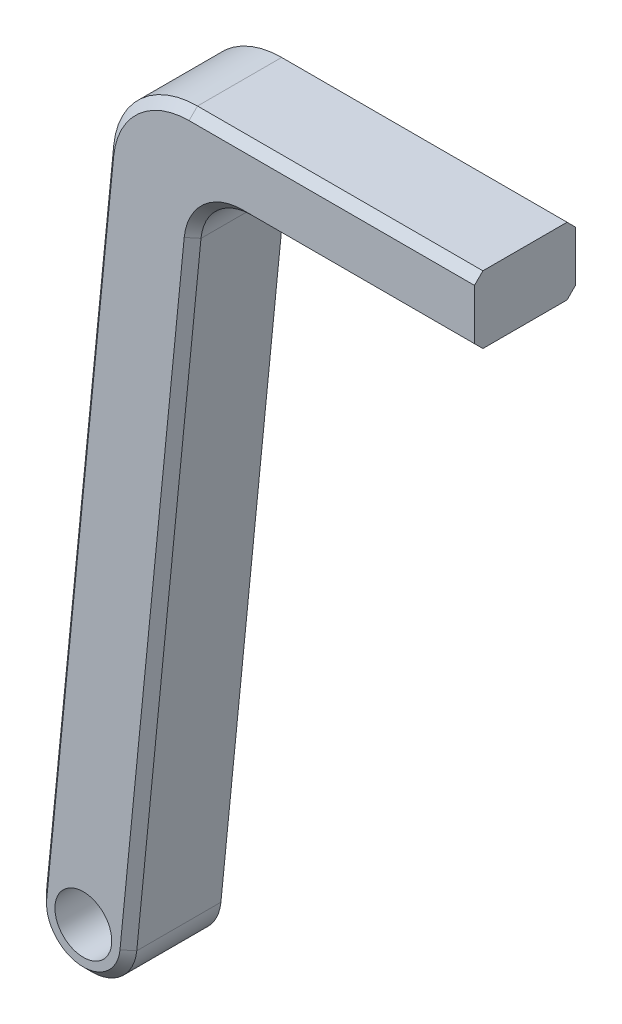
ISO-10303-21;
HEADER;
FILE_DESCRIPTION(('STEP AP214'),'2;1');
FILE_NAME('part.step','',(''),(''),'','','');
FILE_SCHEMA(('AUTOMOTIVE_DESIGN { 1 0 10303 214 1 1 1 1 }'));
ENDSEC;
DATA;
#1=APPLICATION_CONTEXT('core data for automotive mechanical design processes');
#2=APPLICATION_PROTOCOL_DEFINITION('international standard','automotive_design',2000,#1);
#3=PRODUCT_CONTEXT('',#1,'mechanical');
#4=PRODUCT('Part','Part','',(#3));
#5=PRODUCT_RELATED_PRODUCT_CATEGORY('part','',(#4));
#6=PRODUCT_DEFINITION_FORMATION('','',#4);
#7=PRODUCT_DEFINITION_CONTEXT('part definition',#1,'design');
#8=PRODUCT_DEFINITION('design','',#6,#7);
#9=PRODUCT_DEFINITION_SHAPE('','',#8);
#10=(LENGTH_UNIT() NAMED_UNIT(*) SI_UNIT(.MILLI.,.METRE.));
#11=(NAMED_UNIT(*) PLANE_ANGLE_UNIT() SI_UNIT($,.RADIAN.));
#12=(NAMED_UNIT(*) SI_UNIT($,.STERADIAN.) SOLID_ANGLE_UNIT());
#13=UNCERTAINTY_MEASURE_WITH_UNIT(LENGTH_MEASURE(1.E-05),#10,'distance_accuracy_value','');
#14=(GEOMETRIC_REPRESENTATION_CONTEXT(3) GLOBAL_UNCERTAINTY_ASSIGNED_CONTEXT((#13)) GLOBAL_UNIT_ASSIGNED_CONTEXT((#10,
#11,#12)) REPRESENTATION_CONTEXT('',''));
#15=CARTESIAN_POINT('',(0.,0.,0.));
#16=DIRECTION('',(0.,0.,1.));
#17=DIRECTION('',(1.,0.,0.));
#18=AXIS2_PLACEMENT_3D('',#15,#16,#17);
#19=CARTESIAN_POINT('',(-5.34887231495326,0.52932972552715,12.));
#20=DIRECTION('',(0.99513903534014,-0.0984799489352835,0.));
#21=DIRECTION('',(0.0984799489352836,0.99513903534014,0.));
#22=AXIS2_PLACEMENT_3D('',#19,#20,#21);
#23=PLANE('',#22);
#24=DIRECTION('',(0.,0.,-1.));
#25=VECTOR('',#24,1.);
#26=CARTESIAN_POINT('',(2.61308101270173,80.9847994893528,0.));
#27=LINE('',#26,#25);
#28=CARTESIAN_POINT('',(2.61308101270173,80.9847994893528,11.));
#29=VERTEX_POINT('',#28);
#30=CARTESIAN_POINT('',(2.61308101270173,80.9847994893528,1.));
#31=VERTEX_POINT('',#30);
#32=EDGE_CURVE('E336',#29,#31,#27,.T.);
#33=ORIENTED_EDGE('',*,*,#32,.T.);
#34=DIRECTION('',(-0.0984799489352836,-0.99513903534014,0.));
#35=VECTOR('',#34,1.);
#36=CARTESIAN_POINT('',(-5.34887231495326,0.52932972552715,1.));
#37=LINE('',#36,#35);
#38=CARTESIAN_POINT('',(-5.34887231495326,0.529329725527149,1.));
#39=VERTEX_POINT('',#38);
#40=EDGE_CURVE('E218',#31,#39,#37,.T.);
#41=ORIENTED_EDGE('',*,*,#40,.T.);
#42=DIRECTION('',(0.,0.,-1.));
#43=VECTOR('',#42,1.);
#44=CARTESIAN_POINT('',(-5.34887231495326,0.529329725527149,12.));
#45=LINE('',#44,#43);
#46=CARTESIAN_POINT('',(-5.34887231495326,0.529329725527149,11.));
#47=VERTEX_POINT('',#46);
#48=EDGE_CURVE('E324',#47,#39,#45,.T.);
#49=ORIENTED_EDGE('',*,*,#48,.F.);
#50=DIRECTION('',(0.0984799489352836,0.99513903534014,0.));
#51=VECTOR('',#50,1.);
#52=CARTESIAN_POINT('',(2.61308101270173,80.9847994893529,11.));
#53=LINE('',#52,#51);
#54=EDGE_CURVE('E215',#47,#29,#53,.T.);
#55=ORIENTED_EDGE('',*,*,#54,.T.);
#56=EDGE_LOOP('',(#33,#41,#49,#55));
#57=FACE_BOUND('',#56,.T.);
#58=ADVANCED_FACE('F43',(#57),#23,.F.);
#59=CARTESIAN_POINT('',(0.,0.,12.));
#60=DIRECTION('',(0.,0.,-1.));
#61=DIRECTION('',(-1.,0.,0.));
#62=AXIS2_PLACEMENT_3D('',#59,#60,#61);
#63=CYLINDRICAL_SURFACE('',#62,5.375);
#64=ORIENTED_EDGE('',*,*,#48,.T.);
#65=CARTESIAN_POINT('',(0.,0.,1.));
#66=DIRECTION('',(0.,0.,1.));
#67=DIRECTION('',(1.,0.,0.));
#68=AXIS2_PLACEMENT_3D('',#65,#66,#67);
#69=CIRCLE('',#68,5.375);
#70=CARTESIAN_POINT('',(5.34887231495325,-0.529329725527149,1.));
#71=VERTEX_POINT('',#70);
#72=EDGE_CURVE('E212',#39,#71,#69,.T.);
#73=ORIENTED_EDGE('',*,*,#72,.T.);
#74=DIRECTION('',(0.,0.,-1.));
#75=VECTOR('',#74,1.);
#76=CARTESIAN_POINT('',(5.34887231495325,-0.529329725527149,12.));
#77=LINE('',#76,#75);
#78=CARTESIAN_POINT('',(5.34887231495325,-0.529329725527149,11.));
#79=VERTEX_POINT('',#78);
#80=EDGE_CURVE('E314',#79,#71,#77,.T.);
#81=ORIENTED_EDGE('',*,*,#80,.F.);
#82=CARTESIAN_POINT('',(0.,0.,11.));
#83=DIRECTION('',(0.,0.,1.));
#84=DIRECTION('',(1.,0.,0.));
#85=AXIS2_PLACEMENT_3D('',#82,#83,#84);
#86=CIRCLE('',#85,5.375);
#87=EDGE_CURVE('E209',#79,#47,#86,.F.);
#88=ORIENTED_EDGE('',*,*,#87,.T.);
#89=EDGE_LOOP('',(#64,#73,#81,#88));
#90=FACE_BOUND('',#89,.T.);
#91=ADVANCED_FACE('F423',(#90),#63,.T.);
#92=CARTESIAN_POINT('',(5.34887231495325,-0.529329725527149,12.));
#93=DIRECTION('',(0.99513903534014,-0.0984799489352834,0.));
#94=DIRECTION('',(0.0984799489352834,0.99513903534014,0.));
#95=AXIS2_PLACEMENT_3D('',#92,#93,#94);
#96=PLANE('',#95);
#97=ORIENTED_EDGE('',*,*,#80,.T.);
#98=DIRECTION('',(0.0984799489352834,0.99513903534014,0.));
#99=VECTOR('',#98,1.);
#100=CARTESIAN_POINT('',(12.980764960868,76.5908796936117,1.));
#101=LINE('',#100,#99);
#102=CARTESIAN_POINT('',(12.980764960868,76.5908796936117,1.));
#103=VERTEX_POINT('',#102);
#104=EDGE_CURVE('E206',#71,#103,#101,.T.);
#105=ORIENTED_EDGE('',*,*,#104,.T.);
#106=DIRECTION('',(0.,0.,-1.));
#107=VECTOR('',#106,1.);
#108=CARTESIAN_POINT('',(12.980764960868,76.5908796936117,12.));
#109=LINE('',#108,#107);
#110=CARTESIAN_POINT('',(12.980764960868,76.5908796936117,11.));
#111=VERTEX_POINT('',#110);
#112=EDGE_CURVE('E332',#103,#111,#109,.F.);
#113=ORIENTED_EDGE('',*,*,#112,.T.);
#114=DIRECTION('',(-0.0984799489352834,-0.99513903534014,0.));
#115=VECTOR('',#114,1.);
#116=CARTESIAN_POINT('',(5.34887231495325,-0.529329725527149,11.));
#117=LINE('',#116,#115);
#118=EDGE_CURVE('E203',#111,#79,#117,.T.);
#119=ORIENTED_EDGE('',*,*,#118,.T.);
#120=EDGE_LOOP('',(#97,#105,#113,#119));
#121=FACE_BOUND('',#120,.T.);
#122=ADVANCED_FACE('F393',(#121),#96,.T.);
#123=CARTESIAN_POINT('',(0.,82.,12.));
#124=DIRECTION('',(0.,-1.,0.));
#125=DIRECTION('',(0.,0.,-1.));
#126=AXIS2_PLACEMENT_3D('',#123,#124,#125);
#127=PLANE('',#126);
#128=DIRECTION('',(0.,0.,-1.));
#129=VECTOR('',#128,1.);
#130=CARTESIAN_POINT('',(18.9515991729089,82.,0.));
#131=LINE('',#130,#129);
#132=CARTESIAN_POINT('',(18.9515991729089,82.,11.));
#133=VERTEX_POINT('',#132);
#134=CARTESIAN_POINT('',(18.9515991729089,82.,1.));
#135=VERTEX_POINT('',#134);
#136=EDGE_CURVE('E328',#133,#135,#131,.T.);
#137=ORIENTED_EDGE('',*,*,#136,.T.);
#138=DIRECTION('',(1.,0.,0.));
#139=VECTOR('',#138,1.);
#140=CARTESIAN_POINT('',(46.4739345166854,82.,1.));
#141=LINE('',#140,#139);
#142=CARTESIAN_POINT('',(46.4739345166854,82.,1.));
#143=VERTEX_POINT('',#142);
#144=EDGE_CURVE('E363',#135,#143,#141,.T.);
#145=ORIENTED_EDGE('',*,*,#144,.T.);
#146=DIRECTION('',(0.,0.,-1.));
#147=VECTOR('',#146,1.);
#148=CARTESIAN_POINT('',(46.4739345166854,82.,12.));
#149=LINE('',#148,#147);
#150=CARTESIAN_POINT('',(46.4739345166854,82.,11.));
#151=VERTEX_POINT('',#150);
#152=EDGE_CURVE('E309',#151,#143,#149,.T.);
#153=ORIENTED_EDGE('',*,*,#152,.F.);
#154=DIRECTION('',(-1.,0.,0.));
#155=VECTOR('',#154,1.);
#156=CARTESIAN_POINT('',(0.,82.,11.));
#157=LINE('',#156,#155);
#158=EDGE_CURVE('E359',#151,#133,#157,.T.);
#159=ORIENTED_EDGE('',*,*,#158,.T.);
#160=EDGE_LOOP('',(#137,#145,#153,#159));
#161=FACE_BOUND('',#160,.T.);
#162=ADVANCED_FACE('F369',(#161),#127,.T.);
#163=CARTESIAN_POINT('',(46.4739345166854,0.,12.));
#164=DIRECTION('',(1.,0.,0.));
#165=DIRECTION('',(0.,0.,-1.));
#166=AXIS2_PLACEMENT_3D('',#163,#164,#165);
#167=PLANE('',#166);
#168=ORIENTED_EDGE('',*,*,#152,.T.);
#169=DIRECTION('',(0.,0.707106781186552,-0.707106781186543));
#170=VECTOR('',#169,1.);
#171=CARTESIAN_POINT('',(46.4739345166854,35.4999999999994,47.4999999999999));
#172=LINE('',#171,#170);
#173=CARTESIAN_POINT('',(46.4739345166854,83.,0.));
#174=VERTEX_POINT('',#173);
#175=EDGE_CURVE('E179',#143,#174,#172,.T.);
#176=ORIENTED_EDGE('',*,*,#175,.T.);
#177=DIRECTION('',(0.,-1.,0.));
#178=VECTOR('',#177,1.);
#179=CARTESIAN_POINT('',(46.4739345166854,0.,0.));
#180=LINE('',#179,#178);
#181=CARTESIAN_POINT('',(46.4739345166854,89.,0.));
#182=VERTEX_POINT('',#181);
#183=EDGE_CURVE('E161',#182,#174,#180,.T.);
#184=ORIENTED_EDGE('',*,*,#183,.F.);
#185=DIRECTION('',(0.,0.707106781186552,0.707106781186543));
#186=VECTOR('',#185,1.);
#187=CARTESIAN_POINT('',(46.4739345166854,50.4999999999994,-38.5000000000001));
#188=LINE('',#187,#186);
#189=CARTESIAN_POINT('',(46.4739345166854,90.,1.));
#190=VERTEX_POINT('',#189);
#191=EDGE_CURVE('E176',#182,#190,#188,.T.);
#192=ORIENTED_EDGE('',*,*,#191,.T.);
#193=DIRECTION('',(0.,0.,-1.));
#194=VECTOR('',#193,1.);
#195=CARTESIAN_POINT('',(46.4739345166854,90.,12.));
#196=LINE('',#195,#194);
#197=CARTESIAN_POINT('',(46.4739345166854,90.,11.));
#198=VERTEX_POINT('',#197);
#199=EDGE_CURVE('E304',#198,#190,#196,.T.);
#200=ORIENTED_EDGE('',*,*,#199,.F.);
#201=DIRECTION('',(0.,0.707106781186548,-0.707106781186548));
#202=VECTOR('',#201,1.);
#203=CARTESIAN_POINT('',(46.4739345166854,44.5,56.5));
#204=LINE('',#203,#202);
#205=CARTESIAN_POINT('',(46.4739345166854,89.,12.));
#206=VERTEX_POINT('',#205);
#207=EDGE_CURVE('E194',#198,#206,#204,.F.);
#208=ORIENTED_EDGE('',*,*,#207,.T.);
#209=DIRECTION('',(0.,-1.,0.));
#210=VECTOR('',#209,1.);
#211=CARTESIAN_POINT('',(46.4739345166854,0.,12.));
#212=LINE('',#211,#210);
#213=CARTESIAN_POINT('',(46.4739345166854,83.,12.));
#214=VERTEX_POINT('',#213);
#215=EDGE_CURVE('E317',#206,#214,#212,.T.);
#216=ORIENTED_EDGE('',*,*,#215,.T.);
#217=DIRECTION('',(0.,0.707106781186548,0.707106781186548));
#218=VECTOR('',#217,1.);
#219=CARTESIAN_POINT('',(46.4739345166854,41.5,-29.5));
#220=LINE('',#219,#218);
#221=EDGE_CURVE('E188',#214,#151,#220,.F.);
#222=ORIENTED_EDGE('',*,*,#221,.T.);
#223=EDGE_LOOP('',(#168,#176,#184,#192,#200,#208,#216,#222));
#224=FACE_BOUND('',#223,.T.);
#225=ADVANCED_FACE('F174',(#224),#167,.T.);
#226=CARTESIAN_POINT('',(0.,90.,12.));
#227=DIRECTION('',(0.,1.,0.));
#228=DIRECTION('',(0.,0.,1.));
#229=AXIS2_PLACEMENT_3D('',#226,#227,#228);
#230=PLANE('',#229);
#231=ORIENTED_EDGE('',*,*,#199,.T.);
#232=DIRECTION('',(-1.,0.,0.));
#233=VECTOR('',#232,1.);
#234=CARTESIAN_POINT('',(12.5644713661031,90.,1.));
#235=LINE('',#234,#233);
#236=CARTESIAN_POINT('',(12.5644713661031,90.,1.));
#237=VERTEX_POINT('',#236);
#238=EDGE_CURVE('E186',#190,#237,#235,.T.);
#239=ORIENTED_EDGE('',*,*,#238,.T.);
#240=DIRECTION('',(0.,0.,-1.));
#241=VECTOR('',#240,1.);
#242=CARTESIAN_POINT('',(12.5644713661031,90.,12.));
#243=LINE('',#242,#241);
#244=CARTESIAN_POINT('',(12.5644713661031,90.,11.));
#245=VERTEX_POINT('',#244);
#246=EDGE_CURVE('E170',#237,#245,#243,.F.);
#247=ORIENTED_EDGE('',*,*,#246,.T.);
#248=DIRECTION('',(1.,0.,0.));
#249=VECTOR('',#248,1.);
#250=CARTESIAN_POINT('',(0.,90.,11.));
#251=LINE('',#250,#249);
#252=EDGE_CURVE('E227',#245,#198,#251,.T.);
#253=ORIENTED_EDGE('',*,*,#252,.T.);
#254=EDGE_LOOP('',(#231,#239,#247,#253));
#255=FACE_BOUND('',#254,.T.);
#256=ADVANCED_FACE('F303',(#255),#230,.T.);
#257=CARTESIAN_POINT('',(0.,0.,12.));
#258=DIRECTION('',(0.,0.,-1.));
#259=DIRECTION('',(-1.,0.,0.));
#260=AXIS2_PLACEMENT_3D('',#257,#258,#259);
#261=CYLINDRICAL_SURFACE('',#260,3.375);
#262=CARTESIAN_POINT('',(0.,0.,12.));
#263=DIRECTION('',(0.,0.,1.));
#264=DIRECTION('',(1.,0.,0.));
#265=AXIS2_PLACEMENT_3D('',#262,#263,#264);
#266=CIRCLE('',#265,3.375);
#267=CARTESIAN_POINT('',(3.375,0.,12.));
#268=VERTEX_POINT('',#267);
#269=EDGE_CURVE('E310',#268,#268,#266,.T.);
#270=ORIENTED_EDGE('',*,*,#269,.T.);
#271=EDGE_LOOP('',(#270));
#272=FACE_BOUND('',#271,.T.);
#273=CARTESIAN_POINT('',(0.,0.,0.));
#274=DIRECTION('',(0.,0.,1.));
#275=DIRECTION('',(1.,0.,0.));
#276=AXIS2_PLACEMENT_3D('',#273,#274,#275);
#277=CIRCLE('',#276,3.375);
#278=CARTESIAN_POINT('',(3.375,0.,0.));
#279=VERTEX_POINT('',#278);
#280=EDGE_CURVE('E181',#279,#279,#277,.T.);
#281=ORIENTED_EDGE('',*,*,#280,.F.);
#282=EDGE_LOOP('',(#281));
#283=FACE_BOUND('',#282,.T.);
#284=ADVANCED_FACE('F411',(#272,#283),#261,.F.);
#285=CARTESIAN_POINT('',(0.,0.,12.));
#286=DIRECTION('',(0.,0.,1.));
#287=DIRECTION('',(1.,0.,0.));
#288=AXIS2_PLACEMENT_3D('',#285,#286,#287);
#289=PLANE('',#288);
#290=CARTESIAN_POINT('',(18.9515991729089,76.,12.));
#291=DIRECTION('',(0.,0.,1.));
#292=DIRECTION('',(1.,0.,0.));
#293=AXIS2_PLACEMENT_3D('',#290,#291,#292);
#294=CIRCLE('',#293,7.00000000000001);
#295=CARTESIAN_POINT('',(11.9856259255279,76.689359642547,12.));
#296=VERTEX_POINT('',#295);
#297=CARTESIAN_POINT('',(18.9515991729089,83.,12.));
#298=VERTEX_POINT('',#297);
#299=EDGE_CURVE('E53',#296,#298,#294,.F.);
#300=ORIENTED_EDGE('',*,*,#299,.T.);
#301=DIRECTION('',(1.,0.,0.));
#302=VECTOR('',#301,1.);
#303=CARTESIAN_POINT('',(0.,83.,12.));
#304=LINE('',#303,#302);
#305=EDGE_CURVE('E12',#298,#214,#304,.T.);
#306=ORIENTED_EDGE('',*,*,#305,.T.);
#307=ORIENTED_EDGE('',*,*,#215,.F.);
#308=DIRECTION('',(-1.,0.,0.));
#309=VECTOR('',#308,1.);
#310=CARTESIAN_POINT('',(0.,89.,12.));
#311=LINE('',#310,#309);
#312=CARTESIAN_POINT('',(12.5644713661031,89.,12.));
#313=VERTEX_POINT('',#312);
#314=EDGE_CURVE('E232',#206,#313,#311,.T.);
#315=ORIENTED_EDGE('',*,*,#314,.T.);
#316=CARTESIAN_POINT('',(12.5644713661031,80.,12.));
#317=DIRECTION('',(0.,0.,1.));
#318=DIRECTION('',(1.,0.,0.));
#319=AXIS2_PLACEMENT_3D('',#316,#317,#318);
#320=CIRCLE('',#319,8.99999999999999);
#321=CARTESIAN_POINT('',(3.60822004804187,80.8863195404175,12.));
#322=VERTEX_POINT('',#321);
#323=EDGE_CURVE('E235',#313,#322,#320,.T.);
#324=ORIENTED_EDGE('',*,*,#323,.T.);
#325=DIRECTION('',(-0.0984799489352836,-0.99513903534014,0.));
#326=VECTOR('',#325,1.);
#327=CARTESIAN_POINT('',(-4.35373327961312,0.430849776591866,12.));
#328=LINE('',#327,#326);
#329=CARTESIAN_POINT('',(-4.35373327961312,0.430849776591866,12.));
#330=VERTEX_POINT('',#329);
#331=EDGE_CURVE('E238',#322,#330,#328,.T.);
#332=ORIENTED_EDGE('',*,*,#331,.T.);
#333=CARTESIAN_POINT('',(0.,0.,12.));
#334=DIRECTION('',(0.,0.,1.));
#335=DIRECTION('',(1.,0.,0.));
#336=AXIS2_PLACEMENT_3D('',#333,#334,#335);
#337=CIRCLE('',#336,4.375);
#338=CARTESIAN_POINT('',(4.35373327961311,-0.430849776591865,12.));
#339=VERTEX_POINT('',#338);
#340=EDGE_CURVE('E241',#330,#339,#337,.T.);
#341=ORIENTED_EDGE('',*,*,#340,.T.);
#342=DIRECTION('',(0.0984799489352834,0.99513903534014,0.));
#343=VECTOR('',#342,1.);
#344=CARTESIAN_POINT('',(4.35373327961311,-0.430849776591865,12.));
#345=LINE('',#344,#343);
#346=EDGE_CURVE('E64',#339,#296,#345,.T.);
#347=ORIENTED_EDGE('',*,*,#346,.T.);
#348=EDGE_LOOP('',(#300,#306,#307,#315,#324,#332,#341,#347));
#349=FACE_BOUND('',#348,.T.);
#350=ORIENTED_EDGE('',*,*,#269,.F.);
#351=EDGE_LOOP('',(#350));
#352=FACE_BOUND('',#351,.T.);
#353=ADVANCED_FACE('F403',(#349,#352),#289,.T.);
#354=CARTESIAN_POINT('',(0.,0.,0.));
#355=DIRECTION('',(0.,0.,1.));
#356=DIRECTION('',(1.,0.,0.));
#357=AXIS2_PLACEMENT_3D('',#354,#355,#356);
#358=PLANE('',#357);
#359=ORIENTED_EDGE('',*,*,#183,.T.);
#360=DIRECTION('',(-1.,0.,0.));
#361=VECTOR('',#360,1.);
#362=CARTESIAN_POINT('',(18.9515991729089,83.,0.));
#363=LINE('',#362,#361);
#364=CARTESIAN_POINT('',(18.9515991729089,83.,0.));
#365=VERTEX_POINT('',#364);
#366=EDGE_CURVE('E356',#174,#365,#363,.T.);
#367=ORIENTED_EDGE('',*,*,#366,.T.);
#368=CARTESIAN_POINT('',(18.9515991729089,76.,0.));
#369=DIRECTION('',(0.,0.,1.));
#370=DIRECTION('',(1.,0.,0.));
#371=AXIS2_PLACEMENT_3D('',#368,#369,#370);
#372=CIRCLE('',#371,7.00000000000002);
#373=CARTESIAN_POINT('',(11.9856259255279,76.689359642547,0.));
#374=VERTEX_POINT('',#373);
#375=EDGE_CURVE('E353',#365,#374,#372,.T.);
#376=ORIENTED_EDGE('',*,*,#375,.T.);
#377=DIRECTION('',(-0.0984799489352834,-0.99513903534014,0.));
#378=VECTOR('',#377,1.);
#379=CARTESIAN_POINT('',(4.3537332796131,-0.430849776591864,0.));
#380=LINE('',#379,#378);
#381=CARTESIAN_POINT('',(4.3537332796131,-0.430849776591863,0.));
#382=VERTEX_POINT('',#381);
#383=EDGE_CURVE('E350',#374,#382,#380,.T.);
#384=ORIENTED_EDGE('',*,*,#383,.T.);
#385=CARTESIAN_POINT('',(0.,0.,0.));
#386=DIRECTION('',(0.,0.,1.));
#387=DIRECTION('',(1.,0.,0.));
#388=AXIS2_PLACEMENT_3D('',#385,#386,#387);
#389=CIRCLE('',#388,4.37499999999998);
#390=CARTESIAN_POINT('',(-4.35373327961311,0.430849776591865,0.));
#391=VERTEX_POINT('',#390);
#392=EDGE_CURVE('E347',#382,#391,#389,.F.);
#393=ORIENTED_EDGE('',*,*,#392,.T.);
#394=DIRECTION('',(0.0984799489352836,0.99513903534014,0.));
#395=VECTOR('',#394,1.);
#396=CARTESIAN_POINT('',(-4.35373327961311,0.430849776591866,0.));
#397=LINE('',#396,#395);
#398=CARTESIAN_POINT('',(3.60822004804189,80.8863195404175,0.));
#399=VERTEX_POINT('',#398);
#400=EDGE_CURVE('E344',#391,#399,#397,.T.);
#401=ORIENTED_EDGE('',*,*,#400,.T.);
#402=CARTESIAN_POINT('',(12.5644713661031,80.,0.));
#403=DIRECTION('',(0.,0.,1.));
#404=DIRECTION('',(1.,0.,0.));
#405=AXIS2_PLACEMENT_3D('',#402,#403,#404);
#406=CIRCLE('',#405,8.99999999999998);
#407=CARTESIAN_POINT('',(12.5644713661031,89.,0.));
#408=VERTEX_POINT('',#407);
#409=EDGE_CURVE('E164',#399,#408,#406,.F.);
#410=ORIENTED_EDGE('',*,*,#409,.T.);
#411=DIRECTION('',(1.,0.,0.));
#412=VECTOR('',#411,1.);
#413=CARTESIAN_POINT('',(46.4739345166854,89.,0.));
#414=LINE('',#413,#412);
#415=EDGE_CURVE('E156',#408,#182,#414,.T.);
#416=ORIENTED_EDGE('',*,*,#415,.T.);
#417=EDGE_LOOP('',(#359,#367,#376,#384,#393,#401,#410,#416));
#418=FACE_BOUND('',#417,.T.);
#419=ORIENTED_EDGE('',*,*,#280,.T.);
#420=EDGE_LOOP('',(#419));
#421=FACE_BOUND('',#420,.T.);
#422=ADVANCED_FACE('F158',(#418,#421),#358,.F.);
#423=CARTESIAN_POINT('',(18.9515991729089,76.,12.));
#424=DIRECTION('',(0.,0.,1.));
#425=DIRECTION('',(1.,0.,0.));
#426=AXIS2_PLACEMENT_3D('',#423,#424,#425);
#427=CYLINDRICAL_SURFACE('',#426,6.);
#428=ORIENTED_EDGE('',*,*,#112,.F.);
#429=CARTESIAN_POINT('',(18.9515991729089,76.,1.));
#430=DIRECTION('',(0.,0.,1.));
#431=DIRECTION('',(1.,0.,0.));
#432=AXIS2_PLACEMENT_3D('',#429,#430,#431);
#433=CIRCLE('',#432,6.);
#434=EDGE_CURVE('E200',#103,#135,#433,.F.);
#435=ORIENTED_EDGE('',*,*,#434,.T.);
#436=ORIENTED_EDGE('',*,*,#136,.F.);
#437=CARTESIAN_POINT('',(18.9515991729089,76.,11.));
#438=DIRECTION('',(0.,0.,1.));
#439=DIRECTION('',(1.,0.,0.));
#440=AXIS2_PLACEMENT_3D('',#437,#438,#439);
#441=CIRCLE('',#440,6.);
#442=EDGE_CURVE('E192',#133,#111,#441,.T.);
#443=ORIENTED_EDGE('',*,*,#442,.T.);
#444=EDGE_LOOP('',(#428,#435,#436,#443));
#445=FACE_BOUND('',#444,.T.);
#446=ADVANCED_FACE('F389',(#445),#427,.F.);
#447=CARTESIAN_POINT('',(12.5644713661031,80.,12.));
#448=DIRECTION('',(0.,0.,1.));
#449=DIRECTION('',(1.,0.,0.));
#450=AXIS2_PLACEMENT_3D('',#447,#448,#449);
#451=CYLINDRICAL_SURFACE('',#450,10.);
#452=ORIENTED_EDGE('',*,*,#246,.F.);
#453=CARTESIAN_POINT('',(12.5644713661031,80.,1.));
#454=DIRECTION('',(0.,0.,1.));
#455=DIRECTION('',(1.,0.,0.));
#456=AXIS2_PLACEMENT_3D('',#453,#454,#455);
#457=CIRCLE('',#456,10.);
#458=EDGE_CURVE('E224',#237,#31,#457,.T.);
#459=ORIENTED_EDGE('',*,*,#458,.T.);
#460=ORIENTED_EDGE('',*,*,#32,.F.);
#461=CARTESIAN_POINT('',(12.5644713661031,80.,11.));
#462=DIRECTION('',(0.,0.,1.));
#463=DIRECTION('',(1.,0.,0.));
#464=AXIS2_PLACEMENT_3D('',#461,#462,#463);
#465=CIRCLE('',#464,10.);
#466=EDGE_CURVE('E221',#29,#245,#465,.F.);
#467=ORIENTED_EDGE('',*,*,#466,.T.);
#468=EDGE_LOOP('',(#452,#459,#460,#467));
#469=FACE_BOUND('',#468,.T.);
#470=ADVANCED_FACE('F435',(#469),#451,.T.);
#471=CARTESIAN_POINT('',(0.,89.,0.));
#472=DIRECTION('',(0.,0.707106781186542,-0.707106781186552));
#473=DIRECTION('',(-1.,0.,0.));
#474=AXIS2_PLACEMENT_3D('',#471,#472,#473);
#475=PLANE('',#474);
#476=ORIENTED_EDGE('',*,*,#191,.F.);
#477=ORIENTED_EDGE('',*,*,#415,.F.);
#478=DIRECTION('',(0.,-0.707106781186552,-0.707106781186542));
#479=VECTOR('',#478,1.);
#480=CARTESIAN_POINT('',(12.5644713661031,90.,1.));
#481=LINE('',#480,#479);
#482=EDGE_CURVE('E182',#237,#408,#481,.T.);
#483=ORIENTED_EDGE('',*,*,#482,.F.);
#484=ORIENTED_EDGE('',*,*,#238,.F.);
#485=EDGE_LOOP('',(#476,#477,#483,#484));
#486=FACE_BOUND('',#485,.T.);
#487=ADVANCED_FACE('F185',(#486),#475,.T.);
#488=CARTESIAN_POINT('',(12.5644713661031,80.,0.));
#489=DIRECTION('',(0.,0.,1.));
#490=DIRECTION('',(1.,0.,0.));
#491=AXIS2_PLACEMENT_3D('',#488,#489,#490);
#492=CONICAL_SURFACE('',#491,8.99999999999998,0.785398163397458);
#493=ORIENTED_EDGE('',*,*,#482,.T.);
#494=ORIENTED_EDGE('',*,*,#409,.F.);
#495=DIRECTION('',(0.703669560112459,-0.0696358397030477,-0.707106781186541));
#496=VECTOR('',#495,1.);
#497=CARTESIAN_POINT('',(2.61308101270173,80.9847994893528,1.));
#498=LINE('',#497,#496);
#499=EDGE_CURVE('E263',#31,#399,#498,.T.);
#500=ORIENTED_EDGE('',*,*,#499,.F.);
#501=ORIENTED_EDGE('',*,*,#458,.F.);
#502=EDGE_LOOP('',(#493,#494,#500,#501));
#503=FACE_BOUND('',#502,.T.);
#504=ADVANCED_FACE('F452',(#503),#492,.T.);
#505=CARTESIAN_POINT('',(-5.34887231495326,0.52932972552715,1.));
#506=DIRECTION('',(0.703669560112448,-0.0696358397030435,0.707106781186551));
#507=DIRECTION('',(-0.0984799489352836,-0.99513903534014,0.));
#508=AXIS2_PLACEMENT_3D('',#505,#506,#507);
#509=PLANE('',#508);
#510=ORIENTED_EDGE('',*,*,#499,.T.);
#511=ORIENTED_EDGE('',*,*,#400,.F.);
#512=DIRECTION('',(0.703669560112456,-0.0696358397030442,-0.707106781186544));
#513=VECTOR('',#512,1.);
#514=CARTESIAN_POINT('',(-5.34887231495326,0.529329725527149,1.));
#515=LINE('',#514,#513);
#516=EDGE_CURVE('E259',#39,#391,#515,.T.);
#517=ORIENTED_EDGE('',*,*,#516,.F.);
#518=ORIENTED_EDGE('',*,*,#40,.F.);
#519=EDGE_LOOP('',(#510,#511,#517,#518));
#520=FACE_BOUND('',#519,.T.);
#521=ADVANCED_FACE('F448',(#520),#509,.F.);
#522=CARTESIAN_POINT('',(0.,0.,1.));
#523=DIRECTION('',(0.,0.,1.));
#524=DIRECTION('',(1.,0.,0.));
#525=AXIS2_PLACEMENT_3D('',#522,#523,#524);
#526=CONICAL_SURFACE('',#525,5.375,0.785398163397455);
#527=ORIENTED_EDGE('',*,*,#516,.T.);
#528=ORIENTED_EDGE('',*,*,#392,.F.);
#529=DIRECTION('',(-0.703669560112457,0.0696358397030443,-0.707106781186542));
#530=VECTOR('',#529,1.);
#531=CARTESIAN_POINT('',(5.34887231495325,-0.529329725527148,1.));
#532=LINE('',#531,#530);
#533=EDGE_CURVE('E255',#71,#382,#532,.T.);
#534=ORIENTED_EDGE('',*,*,#533,.F.);
#535=ORIENTED_EDGE('',*,*,#72,.F.);
#536=EDGE_LOOP('',(#527,#528,#534,#535));
#537=FACE_BOUND('',#536,.T.);
#538=ADVANCED_FACE('F445',(#537),#526,.T.);
#539=CARTESIAN_POINT('',(4.3537332796131,-0.430849776591864,0.));
#540=DIRECTION('',(0.703669560112447,-0.0696358397030434,-0.707106781186552));
#541=DIRECTION('',(0.0984799489352834,0.99513903534014,0.));
#542=AXIS2_PLACEMENT_3D('',#539,#540,#541);
#543=PLANE('',#542);
#544=ORIENTED_EDGE('',*,*,#533,.T.);
#545=ORIENTED_EDGE('',*,*,#383,.F.);
#546=DIRECTION('',(-0.703669560112457,0.0696358397030478,-0.707106781186543));
#547=VECTOR('',#546,1.);
#548=CARTESIAN_POINT('',(12.980764960868,76.5908796936117,1.));
#549=LINE('',#548,#547);
#550=EDGE_CURVE('E251',#103,#374,#549,.T.);
#551=ORIENTED_EDGE('',*,*,#550,.F.);
#552=ORIENTED_EDGE('',*,*,#104,.F.);
#553=EDGE_LOOP('',(#544,#545,#551,#552));
#554=FACE_BOUND('',#553,.T.);
#555=ADVANCED_FACE('F382',(#554),#543,.T.);
#556=CARTESIAN_POINT('',(18.9515991729089,76.,0.));
#557=DIRECTION('',(0.,0.,-1.));
#558=DIRECTION('',(-1.,0.,0.));
#559=AXIS2_PLACEMENT_3D('',#556,#557,#558);
#560=CONICAL_SURFACE('',#559,7.00000000000002,0.785398163397458);
#561=ORIENTED_EDGE('',*,*,#550,.T.);
#562=ORIENTED_EDGE('',*,*,#375,.F.);
#563=DIRECTION('',(0.,0.707106781186553,-0.707106781186543));
#564=VECTOR('',#563,1.);
#565=CARTESIAN_POINT('',(18.9515991729089,82.,1.));
#566=LINE('',#565,#564);
#567=EDGE_CURVE('E248',#135,#365,#566,.T.);
#568=ORIENTED_EDGE('',*,*,#567,.F.);
#569=ORIENTED_EDGE('',*,*,#434,.F.);
#570=EDGE_LOOP('',(#561,#562,#568,#569));
#571=FACE_BOUND('',#570,.T.);
#572=ADVANCED_FACE('F386',(#571),#560,.F.);
#573=CARTESIAN_POINT('',(0.,83.,0.));
#574=DIRECTION('',(0.,-0.707106781186542,-0.707106781186552));
#575=DIRECTION('',(1.,0.,0.));
#576=AXIS2_PLACEMENT_3D('',#573,#574,#575);
#577=PLANE('',#576);
#578=ORIENTED_EDGE('',*,*,#175,.F.);
#579=ORIENTED_EDGE('',*,*,#144,.F.);
#580=ORIENTED_EDGE('',*,*,#567,.T.);
#581=ORIENTED_EDGE('',*,*,#366,.F.);
#582=EDGE_LOOP('',(#578,#579,#580,#581));
#583=FACE_BOUND('',#582,.T.);
#584=ADVANCED_FACE('F375',(#583),#577,.T.);
#585=CARTESIAN_POINT('',(0.,90.,11.));
#586=DIRECTION('',(0.,-0.707106781186547,-0.707106781186547));
#587=DIRECTION('',(1.,0.,0.));
#588=AXIS2_PLACEMENT_3D('',#585,#586,#587);
#589=PLANE('',#588);
#590=ORIENTED_EDGE('',*,*,#207,.F.);
#591=ORIENTED_EDGE('',*,*,#252,.F.);
#592=DIRECTION('',(0.,0.707106781186547,-0.707106781186547));
#593=VECTOR('',#592,1.);
#594=CARTESIAN_POINT('',(12.5644713661031,89.,12.));
#595=LINE('',#594,#593);
#596=EDGE_CURVE('E47',#313,#245,#595,.T.);
#597=ORIENTED_EDGE('',*,*,#596,.F.);
#598=ORIENTED_EDGE('',*,*,#314,.F.);
#599=EDGE_LOOP('',(#590,#591,#597,#598));
#600=FACE_BOUND('',#599,.T.);
#601=ADVANCED_FACE('F45',(#600),#589,.F.);
#602=CARTESIAN_POINT('',(12.5644713661031,80.,12.));
#603=DIRECTION('',(0.,0.,-1.));
#604=DIRECTION('',(-1.,0.,0.));
#605=AXIS2_PLACEMENT_3D('',#602,#603,#604);
#606=CONICAL_SURFACE('',#605,8.99999999999999,0.785398163397451);
#607=ORIENTED_EDGE('',*,*,#596,.T.);
#608=ORIENTED_EDGE('',*,*,#466,.F.);
#609=DIRECTION('',(-0.703669560112454,0.0696358397030482,-0.707106781186546));
#610=VECTOR('',#609,1.);
#611=CARTESIAN_POINT('',(3.60822004804187,80.8863195404175,12.));
#612=LINE('',#611,#610);
#613=EDGE_CURVE('E283',#322,#29,#612,.T.);
#614=ORIENTED_EDGE('',*,*,#613,.F.);
#615=ORIENTED_EDGE('',*,*,#323,.F.);
#616=EDGE_LOOP('',(#607,#608,#614,#615));
#617=FACE_BOUND('',#616,.T.);
#618=ADVANCED_FACE('F296',(#617),#606,.T.);
#619=CARTESIAN_POINT('',(-4.35373327961312,0.430849776591867,12.));
#620=DIRECTION('',(-0.703669560112453,0.0696358397030439,0.707106781186547));
#621=DIRECTION('',(0.0984799489352836,0.99513903534014,0.));
#622=AXIS2_PLACEMENT_3D('',#619,#620,#621);
#623=PLANE('',#622);
#624=ORIENTED_EDGE('',*,*,#613,.T.);
#625=ORIENTED_EDGE('',*,*,#54,.F.);
#626=DIRECTION('',(-0.703669560112453,0.0696358397030438,-0.707106781186547));
#627=VECTOR('',#626,1.);
#628=CARTESIAN_POINT('',(-4.35373327961312,0.430849776591866,12.));
#629=LINE('',#628,#627);
#630=EDGE_CURVE('E280',#330,#47,#629,.T.);
#631=ORIENTED_EDGE('',*,*,#630,.F.);
#632=ORIENTED_EDGE('',*,*,#331,.F.);
#633=EDGE_LOOP('',(#624,#625,#631,#632));
#634=FACE_BOUND('',#633,.T.);
#635=ADVANCED_FACE('F468',(#634),#623,.T.);
#636=CARTESIAN_POINT('',(0.,0.,12.));
#637=DIRECTION('',(0.,0.,-1.));
#638=DIRECTION('',(-1.,0.,0.));
#639=AXIS2_PLACEMENT_3D('',#636,#637,#638);
#640=CONICAL_SURFACE('',#639,4.375,0.785398163397448);
#641=ORIENTED_EDGE('',*,*,#630,.T.);
#642=ORIENTED_EDGE('',*,*,#87,.F.);
#643=DIRECTION('',(0.703669560112452,-0.0696358397030437,-0.707106781186548));
#644=VECTOR('',#643,1.);
#645=CARTESIAN_POINT('',(4.35373327961311,-0.430849776591865,12.));
#646=LINE('',#645,#644);
#647=EDGE_CURVE('E276',#339,#79,#646,.T.);
#648=ORIENTED_EDGE('',*,*,#647,.F.);
#649=ORIENTED_EDGE('',*,*,#340,.F.);
#650=EDGE_LOOP('',(#641,#642,#648,#649));
#651=FACE_BOUND('',#650,.T.);
#652=ADVANCED_FACE('F465',(#651),#640,.T.);
#653=CARTESIAN_POINT('',(5.34887231495325,-0.529329725527149,11.));
#654=DIRECTION('',(-0.703669560112453,0.0696358397030439,-0.707106781186547));
#655=DIRECTION('',(-0.0984799489352834,-0.99513903534014,0.));
#656=AXIS2_PLACEMENT_3D('',#653,#654,#655);
#657=PLANE('',#656);
#658=ORIENTED_EDGE('',*,*,#647,.T.);
#659=ORIENTED_EDGE('',*,*,#118,.F.);
#660=DIRECTION('',(0.703669560112451,-0.0696358397030485,-0.707106781186548));
#661=VECTOR('',#660,1.);
#662=CARTESIAN_POINT('',(11.9856259255279,76.689359642547,12.));
#663=LINE('',#662,#661);
#664=EDGE_CURVE('E272',#296,#111,#663,.T.);
#665=ORIENTED_EDGE('',*,*,#664,.F.);
#666=ORIENTED_EDGE('',*,*,#346,.F.);
#667=EDGE_LOOP('',(#658,#659,#665,#666));
#668=FACE_BOUND('',#667,.T.);
#669=ADVANCED_FACE('F396',(#668),#657,.F.);
#670=CARTESIAN_POINT('',(18.9515991729089,76.,12.));
#671=DIRECTION('',(0.,0.,1.));
#672=DIRECTION('',(1.,0.,0.));
#673=AXIS2_PLACEMENT_3D('',#670,#671,#672);
#674=CONICAL_SURFACE('',#673,7.00000000000001,0.785398163397451);
#675=ORIENTED_EDGE('',*,*,#664,.T.);
#676=ORIENTED_EDGE('',*,*,#442,.F.);
#677=DIRECTION('',(0.,-0.707106781186547,-0.707106781186547));
#678=VECTOR('',#677,1.);
#679=CARTESIAN_POINT('',(18.9515991729089,83.,12.));
#680=LINE('',#679,#678);
#681=EDGE_CURVE('E269',#298,#133,#680,.T.);
#682=ORIENTED_EDGE('',*,*,#681,.F.);
#683=ORIENTED_EDGE('',*,*,#299,.F.);
#684=EDGE_LOOP('',(#675,#676,#682,#683));
#685=FACE_BOUND('',#684,.T.);
#686=ADVANCED_FACE('F399',(#685),#674,.F.);
#687=CARTESIAN_POINT('',(0.,82.,11.));
#688=DIRECTION('',(0.,0.707106781186547,-0.707106781186547));
#689=DIRECTION('',(-1.,0.,0.));
#690=AXIS2_PLACEMENT_3D('',#687,#688,#689);
#691=PLANE('',#690);
#692=ORIENTED_EDGE('',*,*,#221,.F.);
#693=ORIENTED_EDGE('',*,*,#305,.F.);
#694=ORIENTED_EDGE('',*,*,#681,.T.);
#695=ORIENTED_EDGE('',*,*,#158,.F.);
#696=EDGE_LOOP('',(#692,#693,#694,#695));
#697=FACE_BOUND('',#696,.T.);
#698=ADVANCED_FACE('F402',(#697),#691,.F.);
#699=CLOSED_SHELL('',(#58,#91,#122,#162,#225,#256,#284,#353,#422,#446,#470,#487,#504,#521,#538,
#555,#572,#584,#601,#618,#635,#652,#669,#686,#698));
#700=MANIFOLD_SOLID_BREP('B2',#699);
#701=ADVANCED_BREP_SHAPE_REPRESENTATION('',(#18,#700),#14);
#702=SHAPE_DEFINITION_REPRESENTATION(#9,#701);
ENDSEC;
END-ISO-10303-21;
